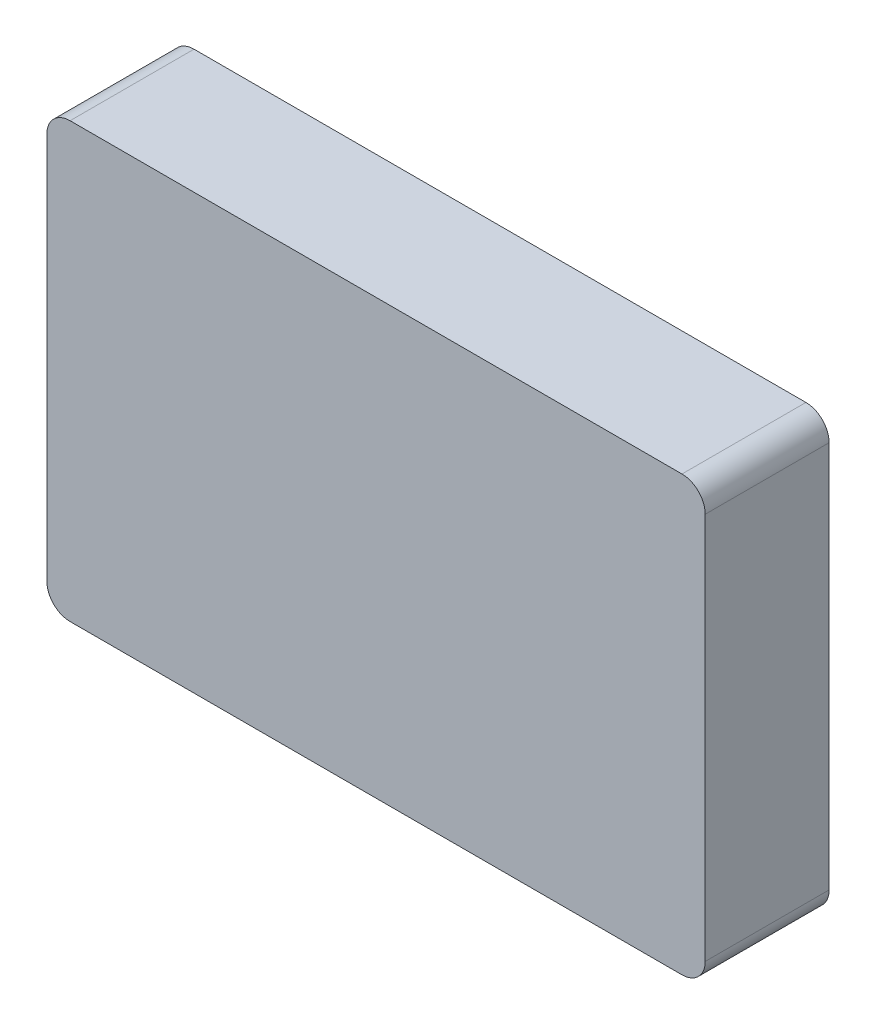
ISO-10303-21;
HEADER;
FILE_DESCRIPTION(('STEP AP214'),'2;1');
FILE_NAME('part.step','',(''),(''),'','','');
FILE_SCHEMA(('AUTOMOTIVE_DESIGN { 1 0 10303 214 1 1 1 1 }'));
ENDSEC;
DATA;
#1=APPLICATION_CONTEXT('core data for automotive mechanical design processes');
#2=APPLICATION_PROTOCOL_DEFINITION('international standard','automotive_design',2000,#1);
#3=PRODUCT_CONTEXT('',#1,'mechanical');
#4=PRODUCT('Part','Part','',(#3));
#5=PRODUCT_RELATED_PRODUCT_CATEGORY('part','',(#4));
#6=PRODUCT_DEFINITION_FORMATION('','',#4);
#7=PRODUCT_DEFINITION_CONTEXT('part definition',#1,'design');
#8=PRODUCT_DEFINITION('design','',#6,#7);
#9=PRODUCT_DEFINITION_SHAPE('','',#8);
#10=(LENGTH_UNIT() NAMED_UNIT(*) SI_UNIT(.MILLI.,.METRE.));
#11=(NAMED_UNIT(*) PLANE_ANGLE_UNIT() SI_UNIT($,.RADIAN.));
#12=(NAMED_UNIT(*) SI_UNIT($,.STERADIAN.) SOLID_ANGLE_UNIT());
#13=UNCERTAINTY_MEASURE_WITH_UNIT(LENGTH_MEASURE(1.E-05),#10,'distance_accuracy_value','');
#14=(GEOMETRIC_REPRESENTATION_CONTEXT(3) GLOBAL_UNCERTAINTY_ASSIGNED_CONTEXT((#13)) GLOBAL_UNIT_ASSIGNED_CONTEXT((#10,
#11,#12)) REPRESENTATION_CONTEXT('',''));
#15=CARTESIAN_POINT('',(0.,0.,0.));
#16=DIRECTION('',(0.,0.,1.));
#17=DIRECTION('',(1.,0.,0.));
#18=AXIS2_PLACEMENT_3D('',#15,#16,#17);
#19=CARTESIAN_POINT('',(39.5,25.,16.));
#20=DIRECTION('',(0.,0.,-1.));
#21=DIRECTION('',(-1.,0.,0.));
#22=AXIS2_PLACEMENT_3D('',#19,#20,#21);
#23=CYLINDRICAL_SURFACE('',#22,3.);
#24=CARTESIAN_POINT('',(39.5,25.,0.));
#25=DIRECTION('',(0.,0.,1.));
#26=DIRECTION('',(-1.,0.,0.));
#27=AXIS2_PLACEMENT_3D('',#24,#25,#26);
#28=CIRCLE('',#27,3.);
#29=CARTESIAN_POINT('',(42.5,25.,0.));
#30=VERTEX_POINT('',#29);
#31=CARTESIAN_POINT('',(39.5,28.,0.));
#32=VERTEX_POINT('',#31);
#33=EDGE_CURVE('E137',#30,#32,#28,.T.);
#34=ORIENTED_EDGE('',*,*,#33,.T.);
#35=DIRECTION('',(0.,0.,-1.));
#36=VECTOR('',#35,1.);
#37=CARTESIAN_POINT('',(39.5,28.,16.));
#38=LINE('',#37,#36);
#39=CARTESIAN_POINT('',(39.5,28.,16.));
#40=VERTEX_POINT('',#39);
#41=EDGE_CURVE('E11',#40,#32,#38,.T.);
#42=ORIENTED_EDGE('',*,*,#41,.F.);
#43=CARTESIAN_POINT('',(39.5,25.,16.));
#44=DIRECTION('',(0.,0.,1.));
#45=DIRECTION('',(-1.,0.,0.));
#46=AXIS2_PLACEMENT_3D('',#43,#44,#45);
#47=CIRCLE('',#46,3.);
#48=CARTESIAN_POINT('',(42.5,25.,16.));
#49=VERTEX_POINT('',#48);
#50=EDGE_CURVE('E151',#49,#40,#47,.T.);
#51=ORIENTED_EDGE('',*,*,#50,.F.);
#52=DIRECTION('',(0.,0.,-1.));
#53=VECTOR('',#52,1.);
#54=CARTESIAN_POINT('',(42.5,25.,16.));
#55=LINE('',#54,#53);
#56=EDGE_CURVE('E133',#49,#30,#55,.T.);
#57=ORIENTED_EDGE('',*,*,#56,.T.);
#58=EDGE_LOOP('',(#34,#42,#51,#57));
#59=FACE_BOUND('',#58,.T.);
#60=ADVANCED_FACE('F41',(#59),#23,.T.);
#61=CARTESIAN_POINT('',(-39.5,28.,16.));
#62=DIRECTION('',(0.,-1.,0.));
#63=DIRECTION('',(1.,0.,0.));
#64=AXIS2_PLACEMENT_3D('',#61,#62,#63);
#65=PLANE('',#64);
#66=DIRECTION('',(-1.,0.,0.));
#67=VECTOR('',#66,1.);
#68=CARTESIAN_POINT('',(-39.5,28.,0.));
#69=LINE('',#68,#67);
#70=CARTESIAN_POINT('',(-39.5,28.,0.));
#71=VERTEX_POINT('',#70);
#72=EDGE_CURVE('E140',#32,#71,#69,.T.);
#73=ORIENTED_EDGE('',*,*,#72,.T.);
#74=DIRECTION('',(0.,0.,-1.));
#75=VECTOR('',#74,1.);
#76=CARTESIAN_POINT('',(-39.5,28.,16.));
#77=LINE('',#76,#75);
#78=CARTESIAN_POINT('',(-39.5,28.,16.));
#79=VERTEX_POINT('',#78);
#80=EDGE_CURVE('E49',#79,#71,#77,.T.);
#81=ORIENTED_EDGE('',*,*,#80,.F.);
#82=DIRECTION('',(-1.,0.,0.));
#83=VECTOR('',#82,1.);
#84=CARTESIAN_POINT('',(-39.5,28.,16.));
#85=LINE('',#84,#83);
#86=EDGE_CURVE('E100',#40,#79,#85,.T.);
#87=ORIENTED_EDGE('',*,*,#86,.F.);
#88=ORIENTED_EDGE('',*,*,#41,.T.);
#89=EDGE_LOOP('',(#73,#81,#87,#88));
#90=FACE_BOUND('',#89,.T.);
#91=ADVANCED_FACE('F186',(#90),#65,.F.);
#92=CARTESIAN_POINT('',(-39.5,25.,16.));
#93=DIRECTION('',(0.,0.,-1.));
#94=DIRECTION('',(-1.,0.,0.));
#95=AXIS2_PLACEMENT_3D('',#92,#93,#94);
#96=CYLINDRICAL_SURFACE('',#95,3.);
#97=CARTESIAN_POINT('',(-39.5,25.,0.));
#98=DIRECTION('',(0.,0.,1.));
#99=DIRECTION('',(-1.,0.,0.));
#100=AXIS2_PLACEMENT_3D('',#97,#98,#99);
#101=CIRCLE('',#100,3.);
#102=CARTESIAN_POINT('',(-42.5,25.,0.));
#103=VERTEX_POINT('',#102);
#104=EDGE_CURVE('E142',#71,#103,#101,.T.);
#105=ORIENTED_EDGE('',*,*,#104,.T.);
#106=DIRECTION('',(0.,0.,-1.));
#107=VECTOR('',#106,1.);
#108=CARTESIAN_POINT('',(-42.5,25.,16.));
#109=LINE('',#108,#107);
#110=CARTESIAN_POINT('',(-42.5,25.,16.));
#111=VERTEX_POINT('',#110);
#112=EDGE_CURVE('E158',#111,#103,#109,.T.);
#113=ORIENTED_EDGE('',*,*,#112,.F.);
#114=CARTESIAN_POINT('',(-39.5,25.,16.));
#115=DIRECTION('',(0.,0.,1.));
#116=DIRECTION('',(-1.,0.,0.));
#117=AXIS2_PLACEMENT_3D('',#114,#115,#116);
#118=CIRCLE('',#117,3.);
#119=EDGE_CURVE('E166',#79,#111,#118,.T.);
#120=ORIENTED_EDGE('',*,*,#119,.F.);
#121=ORIENTED_EDGE('',*,*,#80,.T.);
#122=EDGE_LOOP('',(#105,#113,#120,#121));
#123=FACE_BOUND('',#122,.T.);
#124=ADVANCED_FACE('F164',(#123),#96,.T.);
#125=CARTESIAN_POINT('',(-42.5,25.,16.));
#126=DIRECTION('',(1.,0.,0.));
#127=DIRECTION('',(0.,1.,0.));
#128=AXIS2_PLACEMENT_3D('',#125,#126,#127);
#129=PLANE('',#128);
#130=DIRECTION('',(0.,-1.,0.));
#131=VECTOR('',#130,1.);
#132=CARTESIAN_POINT('',(-42.5,25.,0.));
#133=LINE('',#132,#131);
#134=CARTESIAN_POINT('',(-42.5,-25.,0.));
#135=VERTEX_POINT('',#134);
#136=EDGE_CURVE('E144',#103,#135,#133,.T.);
#137=ORIENTED_EDGE('',*,*,#136,.T.);
#138=DIRECTION('',(0.,0.,-1.));
#139=VECTOR('',#138,1.);
#140=CARTESIAN_POINT('',(-42.5,-25.,16.));
#141=LINE('',#140,#139);
#142=CARTESIAN_POINT('',(-42.5,-25.,16.));
#143=VERTEX_POINT('',#142);
#144=EDGE_CURVE('E155',#143,#135,#141,.T.);
#145=ORIENTED_EDGE('',*,*,#144,.F.);
#146=DIRECTION('',(0.,-1.,0.));
#147=VECTOR('',#146,1.);
#148=CARTESIAN_POINT('',(-42.5,25.,16.));
#149=LINE('',#148,#147);
#150=EDGE_CURVE('E178',#111,#143,#149,.T.);
#151=ORIENTED_EDGE('',*,*,#150,.F.);
#152=ORIENTED_EDGE('',*,*,#112,.T.);
#153=EDGE_LOOP('',(#137,#145,#151,#152));
#154=FACE_BOUND('',#153,.T.);
#155=ADVANCED_FACE('F174',(#154),#129,.F.);
#156=CARTESIAN_POINT('',(-39.5,-25.,16.));
#157=DIRECTION('',(0.,0.,-1.));
#158=DIRECTION('',(-1.,0.,0.));
#159=AXIS2_PLACEMENT_3D('',#156,#157,#158);
#160=CYLINDRICAL_SURFACE('',#159,2.99999999999999);
#161=CARTESIAN_POINT('',(-39.5,-25.,0.));
#162=DIRECTION('',(0.,0.,1.));
#163=DIRECTION('',(-1.,0.,0.));
#164=AXIS2_PLACEMENT_3D('',#161,#162,#163);
#165=CIRCLE('',#164,2.99999999999999);
#166=CARTESIAN_POINT('',(-39.5,-28.,0.));
#167=VERTEX_POINT('',#166);
#168=EDGE_CURVE('E146',#135,#167,#165,.T.);
#169=ORIENTED_EDGE('',*,*,#168,.T.);
#170=DIRECTION('',(0.,0.,-1.));
#171=VECTOR('',#170,1.);
#172=CARTESIAN_POINT('',(-39.5,-28.,16.));
#173=LINE('',#172,#171);
#174=CARTESIAN_POINT('',(-39.5,-28.,16.));
#175=VERTEX_POINT('',#174);
#176=EDGE_CURVE('E128',#175,#167,#173,.T.);
#177=ORIENTED_EDGE('',*,*,#176,.F.);
#178=CARTESIAN_POINT('',(-39.5,-25.,16.));
#179=DIRECTION('',(0.,0.,1.));
#180=DIRECTION('',(-1.,0.,0.));
#181=AXIS2_PLACEMENT_3D('',#178,#179,#180);
#182=CIRCLE('',#181,2.99999999999999);
#183=EDGE_CURVE('E119',#143,#175,#182,.T.);
#184=ORIENTED_EDGE('',*,*,#183,.F.);
#185=ORIENTED_EDGE('',*,*,#144,.T.);
#186=EDGE_LOOP('',(#169,#177,#184,#185));
#187=FACE_BOUND('',#186,.T.);
#188=ADVANCED_FACE('F177',(#187),#160,.T.);
#189=CARTESIAN_POINT('',(-39.5,-28.,16.));
#190=DIRECTION('',(0.,1.,0.));
#191=DIRECTION('',(-1.,0.,0.));
#192=AXIS2_PLACEMENT_3D('',#189,#190,#191);
#193=PLANE('',#192);
#194=DIRECTION('',(1.,0.,0.));
#195=VECTOR('',#194,1.);
#196=CARTESIAN_POINT('',(-39.5,-28.,0.));
#197=LINE('',#196,#195);
#198=CARTESIAN_POINT('',(39.5,-28.,0.));
#199=VERTEX_POINT('',#198);
#200=EDGE_CURVE('E127',#167,#199,#197,.T.);
#201=ORIENTED_EDGE('',*,*,#200,.T.);
#202=DIRECTION('',(0.,0.,-1.));
#203=VECTOR('',#202,1.);
#204=CARTESIAN_POINT('',(39.5,-28.,16.));
#205=LINE('',#204,#203);
#206=CARTESIAN_POINT('',(39.5,-28.,16.));
#207=VERTEX_POINT('',#206);
#208=EDGE_CURVE('E124',#207,#199,#205,.T.);
#209=ORIENTED_EDGE('',*,*,#208,.F.);
#210=DIRECTION('',(1.,0.,0.));
#211=VECTOR('',#210,1.);
#212=CARTESIAN_POINT('',(-39.5,-28.,16.));
#213=LINE('',#212,#211);
#214=EDGE_CURVE('E113',#175,#207,#213,.T.);
#215=ORIENTED_EDGE('',*,*,#214,.F.);
#216=ORIENTED_EDGE('',*,*,#176,.T.);
#217=EDGE_LOOP('',(#201,#209,#215,#216));
#218=FACE_BOUND('',#217,.T.);
#219=ADVANCED_FACE('F125',(#218),#193,.F.);
#220=CARTESIAN_POINT('',(39.5,-25.,16.));
#221=DIRECTION('',(0.,0.,-1.));
#222=DIRECTION('',(-1.,0.,0.));
#223=AXIS2_PLACEMENT_3D('',#220,#221,#222);
#224=CYLINDRICAL_SURFACE('',#223,3.);
#225=CARTESIAN_POINT('',(39.5,-25.,0.));
#226=DIRECTION('',(0.,0.,1.));
#227=DIRECTION('',(1.,0.,0.));
#228=AXIS2_PLACEMENT_3D('',#225,#226,#227);
#229=CIRCLE('',#228,3.);
#230=CARTESIAN_POINT('',(42.5,-25.,0.));
#231=VERTEX_POINT('',#230);
#232=EDGE_CURVE('E86',#199,#231,#229,.T.);
#233=ORIENTED_EDGE('',*,*,#232,.T.);
#234=DIRECTION('',(0.,0.,-1.));
#235=VECTOR('',#234,1.);
#236=CARTESIAN_POINT('',(42.5,-25.,16.));
#237=LINE('',#236,#235);
#238=CARTESIAN_POINT('',(42.5,-25.,16.));
#239=VERTEX_POINT('',#238);
#240=EDGE_CURVE('E129',#239,#231,#237,.T.);
#241=ORIENTED_EDGE('',*,*,#240,.F.);
#242=CARTESIAN_POINT('',(39.5,-25.,16.));
#243=DIRECTION('',(0.,0.,1.));
#244=DIRECTION('',(1.,0.,0.));
#245=AXIS2_PLACEMENT_3D('',#242,#243,#244);
#246=CIRCLE('',#245,3.);
#247=EDGE_CURVE('E117',#207,#239,#246,.T.);
#248=ORIENTED_EDGE('',*,*,#247,.F.);
#249=ORIENTED_EDGE('',*,*,#208,.T.);
#250=EDGE_LOOP('',(#233,#241,#248,#249));
#251=FACE_BOUND('',#250,.T.);
#252=ADVANCED_FACE('F131',(#251),#224,.T.);
#253=CARTESIAN_POINT('',(42.5,25.,16.));
#254=DIRECTION('',(-1.,0.,0.));
#255=DIRECTION('',(0.,0.,1.));
#256=AXIS2_PLACEMENT_3D('',#253,#254,#255);
#257=PLANE('',#256);
#258=DIRECTION('',(0.,1.,0.));
#259=VECTOR('',#258,1.);
#260=CARTESIAN_POINT('',(42.5,25.,0.));
#261=LINE('',#260,#259);
#262=EDGE_CURVE('E92',#231,#30,#261,.T.);
#263=ORIENTED_EDGE('',*,*,#262,.T.);
#264=ORIENTED_EDGE('',*,*,#56,.F.);
#265=DIRECTION('',(0.,1.,0.));
#266=VECTOR('',#265,1.);
#267=CARTESIAN_POINT('',(42.5,25.,16.));
#268=LINE('',#267,#266);
#269=EDGE_CURVE('E57',#239,#49,#268,.T.);
#270=ORIENTED_EDGE('',*,*,#269,.F.);
#271=ORIENTED_EDGE('',*,*,#240,.T.);
#272=EDGE_LOOP('',(#263,#264,#270,#271));
#273=FACE_BOUND('',#272,.T.);
#274=ADVANCED_FACE('F203',(#273),#257,.F.);
#275=CARTESIAN_POINT('',(39.5,25.,16.));
#276=DIRECTION('',(0.,0.,-1.));
#277=DIRECTION('',(-1.,0.,0.));
#278=AXIS2_PLACEMENT_3D('',#275,#276,#277);
#279=PLANE('',#278);
#280=ORIENTED_EDGE('',*,*,#50,.T.);
#281=ORIENTED_EDGE('',*,*,#86,.T.);
#282=ORIENTED_EDGE('',*,*,#119,.T.);
#283=ORIENTED_EDGE('',*,*,#150,.T.);
#284=ORIENTED_EDGE('',*,*,#183,.T.);
#285=ORIENTED_EDGE('',*,*,#214,.T.);
#286=ORIENTED_EDGE('',*,*,#247,.T.);
#287=ORIENTED_EDGE('',*,*,#269,.T.);
#288=EDGE_LOOP('',(#280,#281,#282,#283,#284,#285,#286,#287));
#289=FACE_BOUND('',#288,.T.);
#290=ADVANCED_FACE('F115',(#289),#279,.F.);
#291=CARTESIAN_POINT('',(39.5,25.,0.));
#292=DIRECTION('',(0.,0.,-1.));
#293=DIRECTION('',(-1.,0.,0.));
#294=AXIS2_PLACEMENT_3D('',#291,#292,#293);
#295=PLANE('',#294);
#296=ORIENTED_EDGE('',*,*,#33,.F.);
#297=ORIENTED_EDGE('',*,*,#262,.F.);
#298=ORIENTED_EDGE('',*,*,#232,.F.);
#299=ORIENTED_EDGE('',*,*,#200,.F.);
#300=ORIENTED_EDGE('',*,*,#168,.F.);
#301=ORIENTED_EDGE('',*,*,#136,.F.);
#302=ORIENTED_EDGE('',*,*,#104,.F.);
#303=ORIENTED_EDGE('',*,*,#72,.F.);
#304=EDGE_LOOP('',(#296,#297,#298,#299,#300,#301,#302,#303));
#305=FACE_BOUND('',#304,.T.);
#306=ADVANCED_FACE('F170',(#305),#295,.T.);
#307=CLOSED_SHELL('',(#60,#91,#124,#155,#188,#219,#252,#274,#290,#306));
#308=MANIFOLD_SOLID_BREP('B2',#307);
#309=ADVANCED_BREP_SHAPE_REPRESENTATION('',(#18,#308),#14);
#310=SHAPE_DEFINITION_REPRESENTATION(#9,#309);
ENDSEC;
END-ISO-10303-21;
